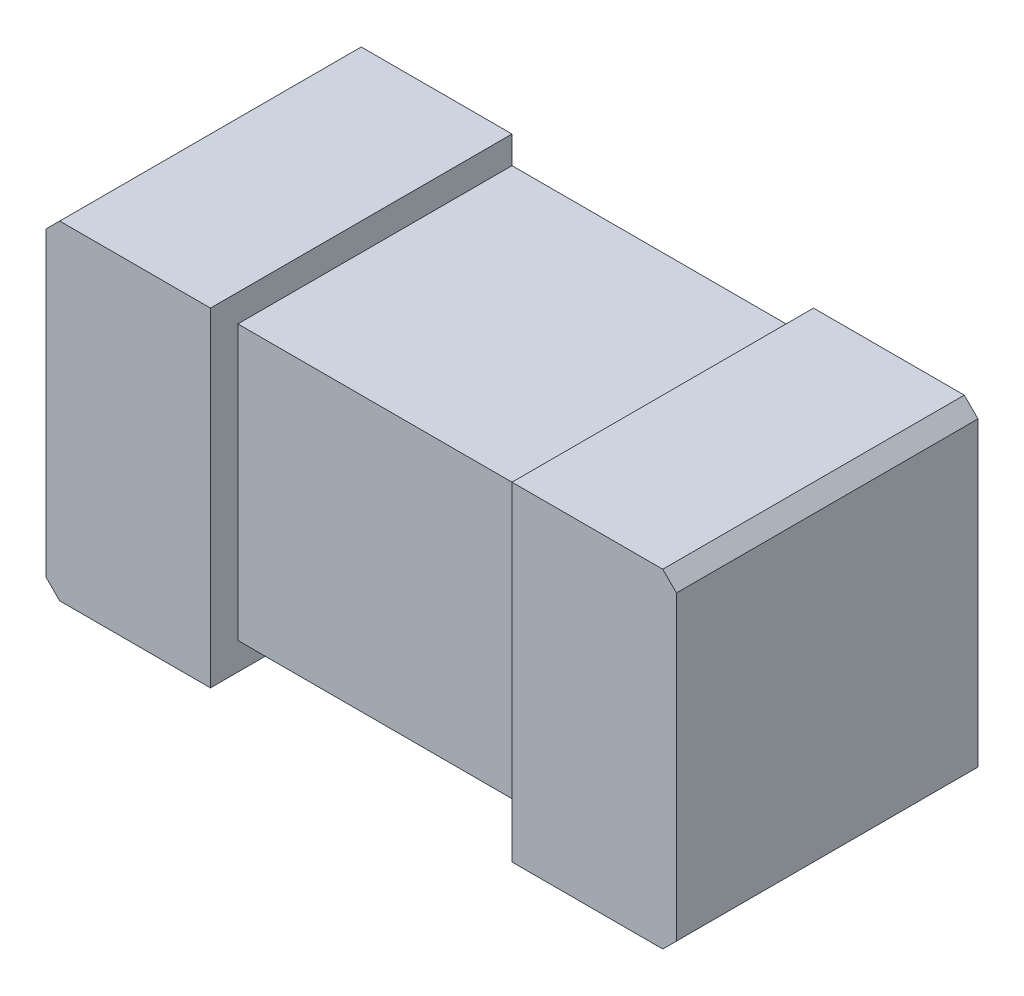
ISO-10303-21;
HEADER;
FILE_DESCRIPTION(('STEP AP214'),'2;1');
FILE_NAME('part.step','',(''),(''),'','','');
FILE_SCHEMA(('AUTOMOTIVE_DESIGN { 1 0 10303 214 1 1 1 1 }'));
ENDSEC;
DATA;
#1=APPLICATION_CONTEXT('core data for automotive mechanical design processes');
#2=APPLICATION_PROTOCOL_DEFINITION('international standard','automotive_design',2000,#1);
#3=PRODUCT_CONTEXT('',#1,'mechanical');
#4=PRODUCT('Part','Part','',(#3));
#5=PRODUCT_RELATED_PRODUCT_CATEGORY('part','',(#4));
#6=PRODUCT_DEFINITION_FORMATION('','',#4);
#7=PRODUCT_DEFINITION_CONTEXT('part definition',#1,'design');
#8=PRODUCT_DEFINITION('design','',#6,#7);
#9=PRODUCT_DEFINITION_SHAPE('','',#8);
#10=(LENGTH_UNIT() NAMED_UNIT(*) SI_UNIT(.MILLI.,.METRE.));
#11=(NAMED_UNIT(*) PLANE_ANGLE_UNIT() SI_UNIT($,.RADIAN.));
#12=(NAMED_UNIT(*) SI_UNIT($,.STERADIAN.) SOLID_ANGLE_UNIT());
#13=UNCERTAINTY_MEASURE_WITH_UNIT(LENGTH_MEASURE(1.E-05),#10,'distance_accuracy_value','');
#14=(GEOMETRIC_REPRESENTATION_CONTEXT(3) GLOBAL_UNCERTAINTY_ASSIGNED_CONTEXT((#13)) GLOBAL_UNIT_ASSIGNED_CONTEXT((#10,
#11,#12)) REPRESENTATION_CONTEXT('',''));
#15=CARTESIAN_POINT('',(0.,0.,0.));
#16=DIRECTION('',(0.,0.,1.));
#17=DIRECTION('',(1.,0.,0.));
#18=AXIS2_PLACEMENT_3D('',#15,#16,#17);
#19=CARTESIAN_POINT('',(0.,0.85,0.55));
#20=DIRECTION('',(0.,0.,1.));
#21=DIRECTION('',(1.,0.,0.));
#22=AXIS2_PLACEMENT_3D('',#19,#20,#21);
#23=PLANE('',#22);
#24=DIRECTION('',(0.,1.,0.));
#25=VECTOR('',#24,1.);
#26=CARTESIAN_POINT('',(0.275,0.25,0.55));
#27=LINE('',#26,#25);
#28=CARTESIAN_POINT('',(0.275,-0.3,0.55));
#29=VERTEX_POINT('',#28);
#30=CARTESIAN_POINT('',(0.275,0.3,0.55));
#31=VERTEX_POINT('',#30);
#32=EDGE_CURVE('E175',#29,#31,#27,.T.);
#33=ORIENTED_EDGE('',*,*,#32,.F.);
#34=DIRECTION('',(1.,0.,0.));
#35=VECTOR('',#34,1.);
#36=CARTESIAN_POINT('',(-0.55,-0.3,0.55));
#37=LINE('',#36,#35);
#38=CARTESIAN_POINT('',(0.55,-0.3,0.55));
#39=VERTEX_POINT('',#38);
#40=EDGE_CURVE('E221',#29,#39,#37,.T.);
#41=ORIENTED_EDGE('',*,*,#40,.T.);
#42=DIRECTION('',(0.707106781186547,0.707106781186547,0.));
#43=VECTOR('',#42,1.);
#44=CARTESIAN_POINT('',(0.55,-0.3,0.55));
#45=LINE('',#44,#43);
#46=CARTESIAN_POINT('',(0.575,-0.275,0.55));
#47=VERTEX_POINT('',#46);
#48=EDGE_CURVE('E225',#39,#47,#45,.T.);
#49=ORIENTED_EDGE('',*,*,#48,.T.);
#50=DIRECTION('',(0.,1.,0.));
#51=VECTOR('',#50,1.);
#52=CARTESIAN_POINT('',(0.575,-0.275,0.55));
#53=LINE('',#52,#51);
#54=CARTESIAN_POINT('',(0.575,0.275,0.55));
#55=VERTEX_POINT('',#54);
#56=EDGE_CURVE('E227',#47,#55,#53,.T.);
#57=ORIENTED_EDGE('',*,*,#56,.T.);
#58=DIRECTION('',(-0.707106781186547,0.707106781186547,0.));
#59=VECTOR('',#58,1.);
#60=CARTESIAN_POINT('',(0.575,0.275,0.55));
#61=LINE('',#60,#59);
#62=CARTESIAN_POINT('',(0.55,0.3,0.55));
#63=VERTEX_POINT('',#62);
#64=EDGE_CURVE('E208',#55,#63,#61,.T.);
#65=ORIENTED_EDGE('',*,*,#64,.T.);
#66=DIRECTION('',(-1.,0.,0.));
#67=VECTOR('',#66,1.);
#68=CARTESIAN_POINT('',(0.55,0.3,0.55));
#69=LINE('',#68,#67);
#70=EDGE_CURVE('E212',#63,#31,#69,.T.);
#71=ORIENTED_EDGE('',*,*,#70,.T.);
#72=EDGE_LOOP('',(#33,#41,#49,#57,#65,#71));
#73=FACE_BOUND('',#72,.T.);
#74=ADVANCED_FACE('F36',(#73),#23,.T.);
#75=CARTESIAN_POINT('',(-0.55,-0.3,0.55));
#76=DIRECTION('',(0.,1.,0.));
#77=DIRECTION('',(0.,0.,1.));
#78=AXIS2_PLACEMENT_3D('',#75,#76,#77);
#79=PLANE('',#78);
#80=DIRECTION('',(1.,0.,0.));
#81=VECTOR('',#80,1.);
#82=CARTESIAN_POINT('',(-0.55,-0.3,0.));
#83=LINE('',#82,#81);
#84=CARTESIAN_POINT('',(-0.55,-0.3,0.));
#85=VERTEX_POINT('',#84);
#86=CARTESIAN_POINT('',(-0.275,-0.3,0.));
#87=VERTEX_POINT('',#86);
#88=EDGE_CURVE('E201',#85,#87,#83,.T.);
#89=ORIENTED_EDGE('',*,*,#88,.T.);
#90=DIRECTION('',(0.,0.,1.));
#91=VECTOR('',#90,1.);
#92=CARTESIAN_POINT('',(-0.275,-0.3,-9.45));
#93=LINE('',#92,#91);
#94=CARTESIAN_POINT('',(-0.275,-0.3,0.55));
#95=VERTEX_POINT('',#94);
#96=EDGE_CURVE('E163',#87,#95,#93,.T.);
#97=ORIENTED_EDGE('',*,*,#96,.T.);
#98=CARTESIAN_POINT('',(-0.55,-0.3,0.55));
#99=VERTEX_POINT('',#98);
#100=EDGE_CURVE('E222',#99,#95,#37,.T.);
#101=ORIENTED_EDGE('',*,*,#100,.F.);
#102=DIRECTION('',(0.,0.,-1.));
#103=VECTOR('',#102,1.);
#104=CARTESIAN_POINT('',(-0.55,-0.3,0.55));
#105=LINE('',#104,#103);
#106=EDGE_CURVE('E238',#99,#85,#105,.T.);
#107=ORIENTED_EDGE('',*,*,#106,.T.);
#108=EDGE_LOOP('',(#89,#97,#101,#107));
#109=FACE_BOUND('',#108,.T.);
#110=ADVANCED_FACE('F303',(#109),#79,.F.);
#111=CARTESIAN_POINT('',(0.55,0.3,0.55));
#112=DIRECTION('',(0.,-1.,0.));
#113=DIRECTION('',(0.,0.,-1.));
#114=AXIS2_PLACEMENT_3D('',#111,#112,#113);
#115=PLANE('',#114);
#116=DIRECTION('',(-1.,0.,0.));
#117=VECTOR('',#116,1.);
#118=CARTESIAN_POINT('',(0.55,0.3,0.));
#119=LINE('',#118,#117);
#120=CARTESIAN_POINT('',(0.55,0.3,0.));
#121=VERTEX_POINT('',#120);
#122=CARTESIAN_POINT('',(0.275,0.3,0.));
#123=VERTEX_POINT('',#122);
#124=EDGE_CURVE('E191',#121,#123,#119,.T.);
#125=ORIENTED_EDGE('',*,*,#124,.T.);
#126=DIRECTION('',(0.,0.,1.));
#127=VECTOR('',#126,1.);
#128=CARTESIAN_POINT('',(0.275,0.3,-9.45));
#129=LINE('',#128,#127);
#130=EDGE_CURVE('E179',#123,#31,#129,.T.);
#131=ORIENTED_EDGE('',*,*,#130,.T.);
#132=ORIENTED_EDGE('',*,*,#70,.F.);
#133=DIRECTION('',(0.,0.,-1.));
#134=VECTOR('',#133,1.);
#135=CARTESIAN_POINT('',(0.55,0.3,0.55));
#136=LINE('',#135,#134);
#137=EDGE_CURVE('E250',#63,#121,#136,.T.);
#138=ORIENTED_EDGE('',*,*,#137,.T.);
#139=EDGE_LOOP('',(#125,#131,#132,#138));
#140=FACE_BOUND('',#139,.T.);
#141=ADVANCED_FACE('F282',(#140),#115,.F.);
#142=CARTESIAN_POINT('',(0.575,0.275,0.55));
#143=DIRECTION('',(-0.707106781186548,-0.707106781186548,0.));
#144=DIRECTION('',(0.707106781186548,-0.707106781186548,0.));
#145=AXIS2_PLACEMENT_3D('',#142,#143,#144);
#146=PLANE('',#145);
#147=DIRECTION('',(-0.707106781186547,0.707106781186547,0.));
#148=VECTOR('',#147,1.);
#149=CARTESIAN_POINT('',(0.575,0.275,0.));
#150=LINE('',#149,#148);
#151=CARTESIAN_POINT('',(0.575,0.275,0.));
#152=VERTEX_POINT('',#151);
#153=EDGE_CURVE('E181',#152,#121,#150,.T.);
#154=ORIENTED_EDGE('',*,*,#153,.T.);
#155=ORIENTED_EDGE('',*,*,#137,.F.);
#156=ORIENTED_EDGE('',*,*,#64,.F.);
#157=DIRECTION('',(0.,0.,-1.));
#158=VECTOR('',#157,1.);
#159=CARTESIAN_POINT('',(0.575,0.275,0.55));
#160=LINE('',#159,#158);
#161=EDGE_CURVE('E229',#55,#152,#160,.T.);
#162=ORIENTED_EDGE('',*,*,#161,.T.);
#163=EDGE_LOOP('',(#154,#155,#156,#162));
#164=FACE_BOUND('',#163,.T.);
#165=ADVANCED_FACE('F38',(#164),#146,.F.);
#166=CARTESIAN_POINT('',(-0.275,0.3,0.55));
#167=VERTEX_POINT('',#166);
#168=CARTESIAN_POINT('',(-0.55,0.3,0.55));
#169=VERTEX_POINT('',#168);
#170=EDGE_CURVE('E211',#167,#169,#69,.T.);
#171=ORIENTED_EDGE('',*,*,#170,.F.);
#172=DIRECTION('',(0.,0.,1.));
#173=VECTOR('',#172,1.);
#174=CARTESIAN_POINT('',(-0.275,0.3,-9.45));
#175=LINE('',#174,#173);
#176=CARTESIAN_POINT('',(-0.275,0.3,0.));
#177=VERTEX_POINT('',#176);
#178=EDGE_CURVE('E178',#177,#167,#175,.T.);
#179=ORIENTED_EDGE('',*,*,#178,.F.);
#180=CARTESIAN_POINT('',(-0.55,0.3,0.));
#181=VERTEX_POINT('',#180);
#182=EDGE_CURVE('E190',#177,#181,#119,.T.);
#183=ORIENTED_EDGE('',*,*,#182,.T.);
#184=DIRECTION('',(0.,0.,-1.));
#185=VECTOR('',#184,1.);
#186=CARTESIAN_POINT('',(-0.55,0.3,0.55));
#187=LINE('',#186,#185);
#188=EDGE_CURVE('E247',#169,#181,#187,.T.);
#189=ORIENTED_EDGE('',*,*,#188,.F.);
#190=EDGE_LOOP('',(#171,#179,#183,#189));
#191=FACE_BOUND('',#190,.T.);
#192=ADVANCED_FACE('F324',(#191),#115,.F.);
#193=CARTESIAN_POINT('',(-0.55,0.3,0.55));
#194=DIRECTION('',(0.707106781186548,-0.707106781186548,0.));
#195=DIRECTION('',(0.707106781186548,0.707106781186548,0.));
#196=AXIS2_PLACEMENT_3D('',#193,#194,#195);
#197=PLANE('',#196);
#198=DIRECTION('',(-0.707106781186547,-0.707106781186547,0.));
#199=VECTOR('',#198,1.);
#200=CARTESIAN_POINT('',(-0.55,0.3,0.));
#201=LINE('',#200,#199);
#202=CARTESIAN_POINT('',(-0.575,0.275,0.));
#203=VERTEX_POINT('',#202);
#204=EDGE_CURVE('E194',#181,#203,#201,.T.);
#205=ORIENTED_EDGE('',*,*,#204,.T.);
#206=DIRECTION('',(0.,0.,-1.));
#207=VECTOR('',#206,1.);
#208=CARTESIAN_POINT('',(-0.575,0.275,0.55));
#209=LINE('',#208,#207);
#210=CARTESIAN_POINT('',(-0.575,0.275,0.55));
#211=VERTEX_POINT('',#210);
#212=EDGE_CURVE('E244',#211,#203,#209,.T.);
#213=ORIENTED_EDGE('',*,*,#212,.F.);
#214=DIRECTION('',(-0.707106781186547,-0.707106781186547,0.));
#215=VECTOR('',#214,1.);
#216=CARTESIAN_POINT('',(-0.55,0.3,0.55));
#217=LINE('',#216,#215);
#218=EDGE_CURVE('E215',#169,#211,#217,.T.);
#219=ORIENTED_EDGE('',*,*,#218,.F.);
#220=ORIENTED_EDGE('',*,*,#188,.T.);
#221=EDGE_LOOP('',(#205,#213,#219,#220));
#222=FACE_BOUND('',#221,.T.);
#223=ADVANCED_FACE('F331',(#222),#197,.F.);
#224=CARTESIAN_POINT('',(-0.575,0.275,0.55));
#225=DIRECTION('',(1.,0.,0.));
#226=DIRECTION('',(0.,0.,-1.));
#227=AXIS2_PLACEMENT_3D('',#224,#225,#226);
#228=PLANE('',#227);
#229=DIRECTION('',(0.,-1.,0.));
#230=VECTOR('',#229,1.);
#231=CARTESIAN_POINT('',(-0.575,0.275,0.));
#232=LINE('',#231,#230);
#233=CARTESIAN_POINT('',(-0.575,-0.275,0.));
#234=VERTEX_POINT('',#233);
#235=EDGE_CURVE('E196',#203,#234,#232,.T.);
#236=ORIENTED_EDGE('',*,*,#235,.T.);
#237=DIRECTION('',(0.,0.,-1.));
#238=VECTOR('',#237,1.);
#239=CARTESIAN_POINT('',(-0.575,-0.275,0.55));
#240=LINE('',#239,#238);
#241=CARTESIAN_POINT('',(-0.575,-0.275,0.55));
#242=VERTEX_POINT('',#241);
#243=EDGE_CURVE('E241',#242,#234,#240,.T.);
#244=ORIENTED_EDGE('',*,*,#243,.F.);
#245=DIRECTION('',(0.,-1.,0.));
#246=VECTOR('',#245,1.);
#247=CARTESIAN_POINT('',(-0.575,0.275,0.55));
#248=LINE('',#247,#246);
#249=EDGE_CURVE('E217',#211,#242,#248,.T.);
#250=ORIENTED_EDGE('',*,*,#249,.F.);
#251=ORIENTED_EDGE('',*,*,#212,.T.);
#252=EDGE_LOOP('',(#236,#244,#250,#251));
#253=FACE_BOUND('',#252,.T.);
#254=ADVANCED_FACE('F335',(#253),#228,.F.);
#255=CARTESIAN_POINT('',(-0.575,-0.275,0.55));
#256=DIRECTION('',(0.707106781186548,0.707106781186548,0.));
#257=DIRECTION('',(-0.707106781186548,0.707106781186548,0.));
#258=AXIS2_PLACEMENT_3D('',#255,#256,#257);
#259=PLANE('',#258);
#260=DIRECTION('',(0.707106781186547,-0.707106781186547,0.));
#261=VECTOR('',#260,1.);
#262=CARTESIAN_POINT('',(-0.575,-0.275,0.));
#263=LINE('',#262,#261);
#264=EDGE_CURVE('E198',#234,#85,#263,.T.);
#265=ORIENTED_EDGE('',*,*,#264,.T.);
#266=ORIENTED_EDGE('',*,*,#106,.F.);
#267=DIRECTION('',(0.707106781186547,-0.707106781186547,0.));
#268=VECTOR('',#267,1.);
#269=CARTESIAN_POINT('',(-0.575,-0.275,0.55));
#270=LINE('',#269,#268);
#271=EDGE_CURVE('E219',#242,#99,#270,.T.);
#272=ORIENTED_EDGE('',*,*,#271,.F.);
#273=ORIENTED_EDGE('',*,*,#243,.T.);
#274=EDGE_LOOP('',(#265,#266,#272,#273));
#275=FACE_BOUND('',#274,.T.);
#276=ADVANCED_FACE('F301',(#275),#259,.F.);
#277=ORIENTED_EDGE('',*,*,#40,.F.);
#278=DIRECTION('',(0.,0.,1.));
#279=VECTOR('',#278,1.);
#280=CARTESIAN_POINT('',(0.275,-0.3,-9.45));
#281=LINE('',#280,#279);
#282=CARTESIAN_POINT('',(0.275,-0.3,0.));
#283=VERTEX_POINT('',#282);
#284=EDGE_CURVE('E168',#283,#29,#281,.T.);
#285=ORIENTED_EDGE('',*,*,#284,.F.);
#286=CARTESIAN_POINT('',(0.55,-0.3,0.));
#287=VERTEX_POINT('',#286);
#288=EDGE_CURVE('E200',#283,#287,#83,.T.);
#289=ORIENTED_EDGE('',*,*,#288,.T.);
#290=DIRECTION('',(0.,0.,-1.));
#291=VECTOR('',#290,1.);
#292=CARTESIAN_POINT('',(0.55,-0.3,0.55));
#293=LINE('',#292,#291);
#294=EDGE_CURVE('E235',#39,#287,#293,.T.);
#295=ORIENTED_EDGE('',*,*,#294,.F.);
#296=EDGE_LOOP('',(#277,#285,#289,#295));
#297=FACE_BOUND('',#296,.T.);
#298=ADVANCED_FACE('F273',(#297),#79,.F.);
#299=CARTESIAN_POINT('',(0.55,-0.3,0.55));
#300=DIRECTION('',(-0.707106781186548,0.707106781186548,0.));
#301=DIRECTION('',(-0.707106781186548,-0.707106781186548,0.));
#302=AXIS2_PLACEMENT_3D('',#299,#300,#301);
#303=PLANE('',#302);
#304=DIRECTION('',(0.707106781186547,0.707106781186547,0.));
#305=VECTOR('',#304,1.);
#306=CARTESIAN_POINT('',(0.55,-0.3,0.));
#307=LINE('',#306,#305);
#308=CARTESIAN_POINT('',(0.575,-0.275,0.));
#309=VERTEX_POINT('',#308);
#310=EDGE_CURVE('E204',#287,#309,#307,.T.);
#311=ORIENTED_EDGE('',*,*,#310,.T.);
#312=DIRECTION('',(0.,0.,-1.));
#313=VECTOR('',#312,1.);
#314=CARTESIAN_POINT('',(0.575,-0.275,0.55));
#315=LINE('',#314,#313);
#316=EDGE_CURVE('E232',#47,#309,#315,.T.);
#317=ORIENTED_EDGE('',*,*,#316,.F.);
#318=ORIENTED_EDGE('',*,*,#48,.F.);
#319=ORIENTED_EDGE('',*,*,#294,.T.);
#320=EDGE_LOOP('',(#311,#317,#318,#319));
#321=FACE_BOUND('',#320,.T.);
#322=ADVANCED_FACE('F292',(#321),#303,.F.);
#323=CARTESIAN_POINT('',(0.575,-0.275,0.55));
#324=DIRECTION('',(-1.,0.,0.));
#325=DIRECTION('',(0.,0.,1.));
#326=AXIS2_PLACEMENT_3D('',#323,#324,#325);
#327=PLANE('',#326);
#328=DIRECTION('',(0.,1.,0.));
#329=VECTOR('',#328,1.);
#330=CARTESIAN_POINT('',(0.575,-0.275,0.));
#331=LINE('',#330,#329);
#332=EDGE_CURVE('E206',#309,#152,#331,.T.);
#333=ORIENTED_EDGE('',*,*,#332,.T.);
#334=ORIENTED_EDGE('',*,*,#161,.F.);
#335=ORIENTED_EDGE('',*,*,#56,.F.);
#336=ORIENTED_EDGE('',*,*,#316,.T.);
#337=EDGE_LOOP('',(#333,#334,#335,#336));
#338=FACE_BOUND('',#337,.T.);
#339=ADVANCED_FACE('F289',(#338),#327,.F.);
#340=ORIENTED_EDGE('',*,*,#100,.T.);
#341=DIRECTION('',(0.,-1.,0.));
#342=VECTOR('',#341,1.);
#343=CARTESIAN_POINT('',(-0.275,0.3,0.55));
#344=LINE('',#343,#342);
#345=EDGE_CURVE('E166',#167,#95,#344,.T.);
#346=ORIENTED_EDGE('',*,*,#345,.F.);
#347=ORIENTED_EDGE('',*,*,#170,.T.);
#348=ORIENTED_EDGE('',*,*,#218,.T.);
#349=ORIENTED_EDGE('',*,*,#249,.T.);
#350=ORIENTED_EDGE('',*,*,#271,.T.);
#351=EDGE_LOOP('',(#340,#346,#347,#348,#349,#350));
#352=FACE_BOUND('',#351,.T.);
#353=ADVANCED_FACE('F299',(#352),#23,.T.);
#354=CARTESIAN_POINT('',(0.,0.85,0.));
#355=DIRECTION('',(0.,0.,1.));
#356=DIRECTION('',(1.,0.,0.));
#357=AXIS2_PLACEMENT_3D('',#354,#355,#356);
#358=PLANE('',#357);
#359=DIRECTION('',(-1.,0.,0.));
#360=VECTOR('',#359,1.);
#361=CARTESIAN_POINT('',(0.,-0.25,0.));
#362=LINE('',#361,#360);
#363=CARTESIAN_POINT('',(0.275,-0.25,0.));
#364=VERTEX_POINT('',#363);
#365=CARTESIAN_POINT('',(-0.275,-0.25,0.));
#366=VERTEX_POINT('',#365);
#367=EDGE_CURVE('E44',#364,#366,#362,.T.);
#368=ORIENTED_EDGE('',*,*,#367,.T.);
#369=DIRECTION('',(0.,-1.,0.));
#370=VECTOR('',#369,1.);
#371=CARTESIAN_POINT('',(-0.275,0.85,0.));
#372=LINE('',#371,#370);
#373=EDGE_CURVE('E11',#366,#87,#372,.T.);
#374=ORIENTED_EDGE('',*,*,#373,.T.);
#375=ORIENTED_EDGE('',*,*,#88,.F.);
#376=ORIENTED_EDGE('',*,*,#264,.F.);
#377=ORIENTED_EDGE('',*,*,#235,.F.);
#378=ORIENTED_EDGE('',*,*,#204,.F.);
#379=ORIENTED_EDGE('',*,*,#182,.F.);
#380=DIRECTION('',(0.,-1.,0.));
#381=VECTOR('',#380,1.);
#382=CARTESIAN_POINT('',(-0.275,0.85,0.));
#383=LINE('',#382,#381);
#384=CARTESIAN_POINT('',(-0.275,0.25,0.));
#385=VERTEX_POINT('',#384);
#386=EDGE_CURVE('E253',#177,#385,#383,.T.);
#387=ORIENTED_EDGE('',*,*,#386,.T.);
#388=DIRECTION('',(1.,0.,0.));
#389=VECTOR('',#388,1.);
#390=CARTESIAN_POINT('',(0.,0.25,0.));
#391=LINE('',#390,#389);
#392=CARTESIAN_POINT('',(0.275,0.25,0.));
#393=VERTEX_POINT('',#392);
#394=EDGE_CURVE('E256',#385,#393,#391,.T.);
#395=ORIENTED_EDGE('',*,*,#394,.T.);
#396=DIRECTION('',(0.,1.,0.));
#397=VECTOR('',#396,1.);
#398=CARTESIAN_POINT('',(0.274999999999999,0.85,0.));
#399=LINE('',#398,#397);
#400=EDGE_CURVE('E259',#393,#123,#399,.T.);
#401=ORIENTED_EDGE('',*,*,#400,.T.);
#402=ORIENTED_EDGE('',*,*,#124,.F.);
#403=ORIENTED_EDGE('',*,*,#153,.F.);
#404=ORIENTED_EDGE('',*,*,#332,.F.);
#405=ORIENTED_EDGE('',*,*,#310,.F.);
#406=ORIENTED_EDGE('',*,*,#288,.F.);
#407=DIRECTION('',(0.,1.,0.));
#408=VECTOR('',#407,1.);
#409=CARTESIAN_POINT('',(0.274999999999997,0.85,0.));
#410=LINE('',#409,#408);
#411=EDGE_CURVE('E262',#283,#364,#410,.T.);
#412=ORIENTED_EDGE('',*,*,#411,.T.);
#413=EDGE_LOOP('',(#368,#374,#375,#376,#377,#378,#379,#387,#395,#401,#402,#403,#404,#405,#406,#412));
#414=FACE_BOUND('',#413,.T.);
#415=ADVANCED_FACE('F265',(#414),#358,.F.);
#416=CARTESIAN_POINT('',(0.275,0.25,-9.45));
#417=DIRECTION('',(1.,0.,0.));
#418=DIRECTION('',(0.,1.,0.));
#419=AXIS2_PLACEMENT_3D('',#416,#417,#418);
#420=PLANE('',#419);
#421=DIRECTION('',(0.,0.,1.));
#422=VECTOR('',#421,1.);
#423=CARTESIAN_POINT('',(0.275,0.25,-9.45));
#424=LINE('',#423,#422);
#425=CARTESIAN_POINT('',(0.275,0.25,0.5));
#426=VERTEX_POINT('',#425);
#427=EDGE_CURVE('E182',#393,#426,#424,.T.);
#428=ORIENTED_EDGE('',*,*,#427,.T.);
#429=DIRECTION('',(0.,-1.,0.));
#430=VECTOR('',#429,1.);
#431=CARTESIAN_POINT('',(0.275,9.75,0.5));
#432=LINE('',#431,#430);
#433=CARTESIAN_POINT('',(0.275,-0.25,0.5));
#434=VERTEX_POINT('',#433);
#435=EDGE_CURVE('E154',#426,#434,#432,.T.);
#436=ORIENTED_EDGE('',*,*,#435,.T.);
#437=DIRECTION('',(0.,0.,1.));
#438=VECTOR('',#437,1.);
#439=CARTESIAN_POINT('',(0.275,-0.25,-9.45));
#440=LINE('',#439,#438);
#441=EDGE_CURVE('E58',#364,#434,#440,.T.);
#442=ORIENTED_EDGE('',*,*,#441,.F.);
#443=ORIENTED_EDGE('',*,*,#411,.F.);
#444=ORIENTED_EDGE('',*,*,#284,.T.);
#445=ORIENTED_EDGE('',*,*,#32,.T.);
#446=ORIENTED_EDGE('',*,*,#130,.F.);
#447=ORIENTED_EDGE('',*,*,#400,.F.);
#448=EDGE_LOOP('',(#428,#436,#442,#443,#444,#445,#446,#447));
#449=FACE_BOUND('',#448,.T.);
#450=ADVANCED_FACE('F270',(#449),#420,.F.);
#451=CARTESIAN_POINT('',(0.275,0.25,-9.45));
#452=DIRECTION('',(0.,-1.,0.));
#453=DIRECTION('',(1.,0.,0.));
#454=AXIS2_PLACEMENT_3D('',#451,#452,#453);
#455=PLANE('',#454);
#456=DIRECTION('',(0.,0.,1.));
#457=VECTOR('',#456,1.);
#458=CARTESIAN_POINT('',(-0.275,0.25,-9.45));
#459=LINE('',#458,#457);
#460=CARTESIAN_POINT('',(-0.275,0.25,0.5));
#461=VERTEX_POINT('',#460);
#462=EDGE_CURVE('E185',#385,#461,#459,.T.);
#463=ORIENTED_EDGE('',*,*,#462,.T.);
#464=DIRECTION('',(1.,0.,0.));
#465=VECTOR('',#464,1.);
#466=CARTESIAN_POINT('',(0.274999999999998,0.25,0.5));
#467=LINE('',#466,#465);
#468=EDGE_CURVE('E150',#461,#426,#467,.T.);
#469=ORIENTED_EDGE('',*,*,#468,.T.);
#470=ORIENTED_EDGE('',*,*,#427,.F.);
#471=ORIENTED_EDGE('',*,*,#394,.F.);
#472=EDGE_LOOP('',(#463,#469,#470,#471));
#473=FACE_BOUND('',#472,.T.);
#474=ADVANCED_FACE('F424',(#473),#455,.F.);
#475=CARTESIAN_POINT('',(-0.275,0.3,-9.45));
#476=DIRECTION('',(-1.,0.,0.));
#477=DIRECTION('',(0.,0.,1.));
#478=AXIS2_PLACEMENT_3D('',#475,#476,#477);
#479=PLANE('',#478);
#480=ORIENTED_EDGE('',*,*,#178,.T.);
#481=ORIENTED_EDGE('',*,*,#345,.T.);
#482=ORIENTED_EDGE('',*,*,#96,.F.);
#483=ORIENTED_EDGE('',*,*,#373,.F.);
#484=DIRECTION('',(0.,0.,1.));
#485=VECTOR('',#484,1.);
#486=CARTESIAN_POINT('',(-0.275,-0.25,-9.45));
#487=LINE('',#486,#485);
#488=CARTESIAN_POINT('',(-0.275,-0.25,0.5));
#489=VERTEX_POINT('',#488);
#490=EDGE_CURVE('E159',#366,#489,#487,.T.);
#491=ORIENTED_EDGE('',*,*,#490,.T.);
#492=DIRECTION('',(0.,-1.,0.));
#493=VECTOR('',#492,1.);
#494=CARTESIAN_POINT('',(-0.275,9.75,0.5));
#495=LINE('',#494,#493);
#496=EDGE_CURVE('E147',#461,#489,#495,.T.);
#497=ORIENTED_EDGE('',*,*,#496,.F.);
#498=ORIENTED_EDGE('',*,*,#462,.F.);
#499=ORIENTED_EDGE('',*,*,#386,.F.);
#500=EDGE_LOOP('',(#480,#481,#482,#483,#491,#497,#498,#499));
#501=FACE_BOUND('',#500,.T.);
#502=ADVANCED_FACE('F162',(#501),#479,.F.);
#503=CARTESIAN_POINT('',(-0.275,-0.25,-9.45));
#504=DIRECTION('',(0.,1.,0.));
#505=DIRECTION('',(0.,0.,1.));
#506=AXIS2_PLACEMENT_3D('',#503,#504,#505);
#507=PLANE('',#506);
#508=ORIENTED_EDGE('',*,*,#441,.T.);
#509=DIRECTION('',(1.,0.,0.));
#510=VECTOR('',#509,1.);
#511=CARTESIAN_POINT('',(0.275,-0.25,0.5));
#512=LINE('',#511,#510);
#513=EDGE_CURVE('E51',#489,#434,#512,.T.);
#514=ORIENTED_EDGE('',*,*,#513,.F.);
#515=ORIENTED_EDGE('',*,*,#490,.F.);
#516=ORIENTED_EDGE('',*,*,#367,.F.);
#517=EDGE_LOOP('',(#508,#514,#515,#516));
#518=FACE_BOUND('',#517,.T.);
#519=ADVANCED_FACE('F158',(#518),#507,.F.);
#520=CARTESIAN_POINT('',(0.275,9.75,0.5));
#521=DIRECTION('',(0.,0.,-1.));
#522=DIRECTION('',(-1.,0.,0.));
#523=AXIS2_PLACEMENT_3D('',#520,#521,#522);
#524=PLANE('',#523);
#525=ORIENTED_EDGE('',*,*,#496,.T.);
#526=ORIENTED_EDGE('',*,*,#513,.T.);
#527=ORIENTED_EDGE('',*,*,#435,.F.);
#528=ORIENTED_EDGE('',*,*,#468,.F.);
#529=EDGE_LOOP('',(#525,#526,#527,#528));
#530=FACE_BOUND('',#529,.T.);
#531=ADVANCED_FACE('F148',(#530),#524,.F.);
#532=CLOSED_SHELL('',(#74,#110,#141,#165,#192,#223,#254,#276,#298,#322,#339,#353,#415,#450,#474,
#502,#519,#531));
#533=MANIFOLD_SOLID_BREP('B2',#532);
#534=ADVANCED_BREP_SHAPE_REPRESENTATION('',(#18,#533),#14);
#535=SHAPE_DEFINITION_REPRESENTATION(#9,#534);
ENDSEC;
END-ISO-10303-21;
